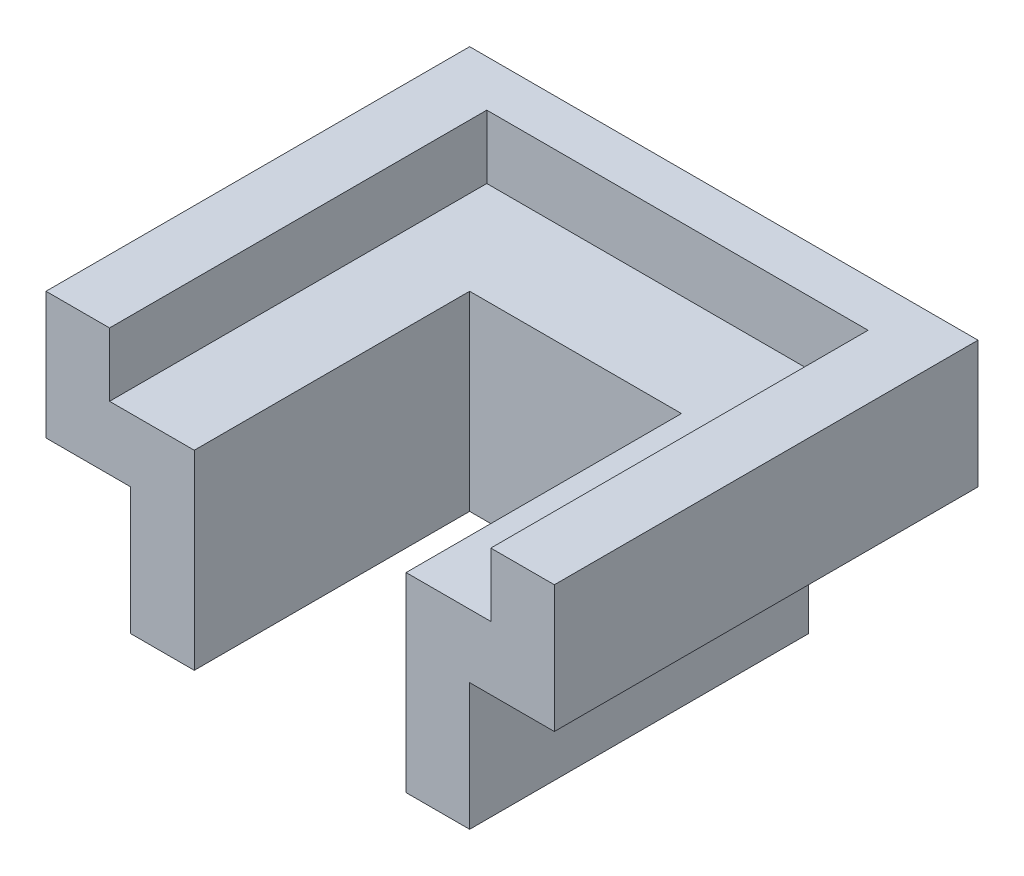
ISO-10303-21;
HEADER;
FILE_DESCRIPTION(('STEP AP214'),'2;1');
FILE_NAME('part.step','',(''),(''),'','','');
FILE_SCHEMA(('AUTOMOTIVE_DESIGN { 1 0 10303 214 1 1 1 1 }'));
ENDSEC;
DATA;
#1=APPLICATION_CONTEXT('core data for automotive mechanical design processes');
#2=APPLICATION_PROTOCOL_DEFINITION('international standard','automotive_design',2000,#1);
#3=PRODUCT_CONTEXT('',#1,'mechanical');
#4=PRODUCT('Part','Part','',(#3));
#5=PRODUCT_RELATED_PRODUCT_CATEGORY('part','',(#4));
#6=PRODUCT_DEFINITION_FORMATION('','',#4);
#7=PRODUCT_DEFINITION_CONTEXT('part definition',#1,'design');
#8=PRODUCT_DEFINITION('design','',#6,#7);
#9=PRODUCT_DEFINITION_SHAPE('','',#8);
#10=(LENGTH_UNIT() NAMED_UNIT(*) SI_UNIT(.MILLI.,.METRE.));
#11=(NAMED_UNIT(*) PLANE_ANGLE_UNIT() SI_UNIT($,.RADIAN.));
#12=(NAMED_UNIT(*) SI_UNIT($,.STERADIAN.) SOLID_ANGLE_UNIT());
#13=UNCERTAINTY_MEASURE_WITH_UNIT(LENGTH_MEASURE(1.E-05),#10,'distance_accuracy_value','');
#14=(GEOMETRIC_REPRESENTATION_CONTEXT(3) GLOBAL_UNCERTAINTY_ASSIGNED_CONTEXT((#13)) GLOBAL_UNIT_ASSIGNED_CONTEXT((#10,
#11,#12)) REPRESENTATION_CONTEXT('',''));
#15=CARTESIAN_POINT('',(0.,0.,0.));
#16=DIRECTION('',(0.,0.,1.));
#17=DIRECTION('',(1.,0.,0.));
#18=AXIS2_PLACEMENT_3D('',#15,#16,#17);
#19=CARTESIAN_POINT('',(38.1,-8.40187074829932,12.2248299319728));
#20=DIRECTION('',(0.,0.,-1.));
#21=DIRECTION('',(-1.,0.,0.));
#22=AXIS2_PLACEMENT_3D('',#19,#20,#21);
#23=PLANE('',#22);
#24=DIRECTION('',(0.,1.,0.));
#25=VECTOR('',#24,1.);
#26=CARTESIAN_POINT('',(-15.875,-27.4518707482993,12.2248299319728));
#27=LINE('',#26,#25);
#28=CARTESIAN_POINT('',(-15.875,-27.4518707482993,12.2248299319728));
#29=VERTEX_POINT('',#28);
#30=CARTESIAN_POINT('',(-15.875,1.12312925170068,12.2248299319728));
#31=VERTEX_POINT('',#30);
#32=EDGE_CURVE('E157',#29,#31,#27,.T.);
#33=ORIENTED_EDGE('',*,*,#32,.T.);
#34=DIRECTION('',(1.,0.,0.));
#35=VECTOR('',#34,1.);
#36=CARTESIAN_POINT('',(-28.575,1.12312925170068,12.2248299319728));
#37=LINE('',#36,#35);
#38=CARTESIAN_POINT('',(-28.575,1.12312925170068,12.2248299319728));
#39=VERTEX_POINT('',#38);
#40=EDGE_CURVE('E170',#39,#31,#37,.T.);
#41=ORIENTED_EDGE('',*,*,#40,.F.);
#42=DIRECTION('',(0.,1.,0.));
#43=VECTOR('',#42,1.);
#44=CARTESIAN_POINT('',(-28.575,1.12312925170068,12.2248299319728));
#45=LINE('',#44,#43);
#46=CARTESIAN_POINT('',(-28.575,10.6481292517007,12.2248299319728));
#47=VERTEX_POINT('',#46);
#48=EDGE_CURVE('E186',#39,#47,#45,.T.);
#49=ORIENTED_EDGE('',*,*,#48,.T.);
#50=DIRECTION('',(-1.,0.,0.));
#51=VECTOR('',#50,1.);
#52=CARTESIAN_POINT('',(38.1,10.6481292517007,12.2248299319728));
#53=LINE('',#52,#51);
#54=CARTESIAN_POINT('',(-38.1,10.6481292517007,12.2248299319728));
#55=VERTEX_POINT('',#54);
#56=EDGE_CURVE('E214',#47,#55,#53,.T.);
#57=ORIENTED_EDGE('',*,*,#56,.T.);
#58=DIRECTION('',(0.,-1.,0.));
#59=VECTOR('',#58,1.);
#60=CARTESIAN_POINT('',(-38.1,-8.40187074829932,12.2248299319728));
#61=LINE('',#60,#59);
#62=CARTESIAN_POINT('',(-38.1,-8.40187074829932,12.2248299319728));
#63=VERTEX_POINT('',#62);
#64=EDGE_CURVE('E198',#55,#63,#61,.T.);
#65=ORIENTED_EDGE('',*,*,#64,.T.);
#66=DIRECTION('',(-1.,0.,0.));
#67=VECTOR('',#66,1.);
#68=CARTESIAN_POINT('',(38.1,-8.40187074829932,12.2248299319728));
#69=LINE('',#68,#67);
#70=CARTESIAN_POINT('',(-25.3999999999999,-8.40187074829932,12.2248299319728));
#71=VERTEX_POINT('',#70);
#72=EDGE_CURVE('E232',#71,#63,#69,.T.);
#73=ORIENTED_EDGE('',*,*,#72,.F.);
#74=DIRECTION('',(0.,1.,0.));
#75=VECTOR('',#74,1.);
#76=CARTESIAN_POINT('',(-25.4,-27.4518707482993,12.2248299319728));
#77=LINE('',#76,#75);
#78=CARTESIAN_POINT('',(-25.4,-27.4518707482993,12.2248299319728));
#79=VERTEX_POINT('',#78);
#80=EDGE_CURVE('E242',#79,#71,#77,.T.);
#81=ORIENTED_EDGE('',*,*,#80,.F.);
#82=DIRECTION('',(-1.,0.,0.));
#83=VECTOR('',#82,1.);
#84=CARTESIAN_POINT('',(-25.4,-27.4518707482993,12.2248299319728));
#85=LINE('',#84,#83);
#86=EDGE_CURVE('E245',#29,#79,#85,.T.);
#87=ORIENTED_EDGE('',*,*,#86,.F.);
#88=EDGE_LOOP('',(#33,#41,#49,#57,#65,#73,#81,#87));
#89=FACE_BOUND('',#88,.T.);
#90=ADVANCED_FACE('F35',(#89),#23,.F.);
#91=CARTESIAN_POINT('',(38.1,-8.40187074829932,12.2248299319728));
#92=DIRECTION('',(0.,1.,0.));
#93=DIRECTION('',(0.,0.,1.));
#94=AXIS2_PLACEMENT_3D('',#91,#92,#93);
#95=PLANE('',#94);
#96=DIRECTION('',(0.,0.,-1.));
#97=VECTOR('',#96,1.);
#98=CARTESIAN_POINT('',(-25.4,-8.40187074829932,12.2248299319728));
#99=LINE('',#98,#97);
#100=CARTESIAN_POINT('',(-25.4,-8.40187074829932,-38.5751700680272));
#101=VERTEX_POINT('',#100);
#102=EDGE_CURVE('E55',#71,#101,#99,.T.);
#103=ORIENTED_EDGE('',*,*,#102,.F.);
#104=ORIENTED_EDGE('',*,*,#72,.T.);
#105=DIRECTION('',(0.,0.,-1.));
#106=VECTOR('',#105,1.);
#107=CARTESIAN_POINT('',(-38.1,-8.40187074829932,12.2248299319728));
#108=LINE('',#107,#106);
#109=CARTESIAN_POINT('',(-38.1,-8.40187074829932,-51.2751700680272));
#110=VERTEX_POINT('',#109);
#111=EDGE_CURVE('E217',#63,#110,#108,.T.);
#112=ORIENTED_EDGE('',*,*,#111,.T.);
#113=DIRECTION('',(-1.,0.,0.));
#114=VECTOR('',#113,1.);
#115=CARTESIAN_POINT('',(38.1,-8.40187074829932,-51.2751700680272));
#116=LINE('',#115,#114);
#117=CARTESIAN_POINT('',(38.1,-8.40187074829932,-51.2751700680272));
#118=VERTEX_POINT('',#117);
#119=EDGE_CURVE('E229',#118,#110,#116,.T.);
#120=ORIENTED_EDGE('',*,*,#119,.F.);
#121=DIRECTION('',(0.,0.,-1.));
#122=VECTOR('',#121,1.);
#123=CARTESIAN_POINT('',(38.1,-8.40187074829932,12.2248299319728));
#124=LINE('',#123,#122);
#125=CARTESIAN_POINT('',(38.1,-8.40187074829932,12.2248299319728));
#126=VERTEX_POINT('',#125);
#127=EDGE_CURVE('E207',#126,#118,#124,.T.);
#128=ORIENTED_EDGE('',*,*,#127,.F.);
#129=CARTESIAN_POINT('',(25.4,-8.40187074829932,12.2248299319728));
#130=VERTEX_POINT('',#129);
#131=EDGE_CURVE('E235',#126,#130,#69,.T.);
#132=ORIENTED_EDGE('',*,*,#131,.T.);
#133=DIRECTION('',(0.,0.,1.));
#134=VECTOR('',#133,1.);
#135=CARTESIAN_POINT('',(25.4,-8.40187074829932,12.2248299319728));
#136=LINE('',#135,#134);
#137=CARTESIAN_POINT('',(25.4,-8.40187074829932,-38.5751700680272));
#138=VERTEX_POINT('',#137);
#139=EDGE_CURVE('E256',#138,#130,#136,.T.);
#140=ORIENTED_EDGE('',*,*,#139,.F.);
#141=DIRECTION('',(1.,0.,0.));
#142=VECTOR('',#141,1.);
#143=CARTESIAN_POINT('',(-25.4,-8.40187074829932,-38.5751700680272));
#144=LINE('',#143,#142);
#145=EDGE_CURVE('E50',#101,#138,#144,.T.);
#146=ORIENTED_EDGE('',*,*,#145,.F.);
#147=EDGE_LOOP('',(#103,#104,#112,#120,#128,#132,#140,#146));
#148=FACE_BOUND('',#147,.T.);
#149=ADVANCED_FACE('F282',(#148),#95,.F.);
#150=CARTESIAN_POINT('',(15.875,1.12312925170068,12.2248299319728));
#151=VERTEX_POINT('',#150);
#152=CARTESIAN_POINT('',(28.575,1.12312925170068,12.2248299319728));
#153=VERTEX_POINT('',#152);
#154=EDGE_CURVE('E177',#151,#153,#37,.T.);
#155=ORIENTED_EDGE('',*,*,#154,.F.);
#156=DIRECTION('',(0.,1.,0.));
#157=VECTOR('',#156,1.);
#158=CARTESIAN_POINT('',(15.875,-27.4518707482993,12.2248299319728));
#159=LINE('',#158,#157);
#160=CARTESIAN_POINT('',(15.875,-27.4518707482993,12.2248299319728));
#161=VERTEX_POINT('',#160);
#162=EDGE_CURVE('E251',#161,#151,#159,.T.);
#163=ORIENTED_EDGE('',*,*,#162,.F.);
#164=DIRECTION('',(-1.,0.,0.));
#165=VECTOR('',#164,1.);
#166=CARTESIAN_POINT('',(15.875,-27.4518707482993,12.2248299319728));
#167=LINE('',#166,#165);
#168=CARTESIAN_POINT('',(25.4,-27.4518707482993,12.2248299319728));
#169=VERTEX_POINT('',#168);
#170=EDGE_CURVE('E311',#169,#161,#167,.T.);
#171=ORIENTED_EDGE('',*,*,#170,.F.);
#172=DIRECTION('',(0.,1.,0.));
#173=VECTOR('',#172,1.);
#174=CARTESIAN_POINT('',(25.4,-27.4518707482993,12.2248299319728));
#175=LINE('',#174,#173);
#176=EDGE_CURVE('E253',#169,#130,#175,.T.);
#177=ORIENTED_EDGE('',*,*,#176,.T.);
#178=ORIENTED_EDGE('',*,*,#131,.F.);
#179=DIRECTION('',(0.,-1.,0.));
#180=VECTOR('',#179,1.);
#181=CARTESIAN_POINT('',(38.1,-8.40187074829932,12.2248299319728));
#182=LINE('',#181,#180);
#183=CARTESIAN_POINT('',(38.1,10.6481292517007,12.2248299319728));
#184=VERTEX_POINT('',#183);
#185=EDGE_CURVE('E204',#184,#126,#182,.T.);
#186=ORIENTED_EDGE('',*,*,#185,.F.);
#187=CARTESIAN_POINT('',(28.575,10.6481292517007,12.2248299319728));
#188=VERTEX_POINT('',#187);
#189=EDGE_CURVE('E223',#184,#188,#53,.T.);
#190=ORIENTED_EDGE('',*,*,#189,.T.);
#191=DIRECTION('',(0.,1.,0.));
#192=VECTOR('',#191,1.);
#193=CARTESIAN_POINT('',(28.575,1.12312925170068,12.2248299319728));
#194=LINE('',#193,#192);
#195=EDGE_CURVE('E201',#153,#188,#194,.T.);
#196=ORIENTED_EDGE('',*,*,#195,.F.);
#197=EDGE_LOOP('',(#155,#163,#171,#177,#178,#186,#190,#196));
#198=FACE_BOUND('',#197,.T.);
#199=ADVANCED_FACE('F37',(#198),#23,.F.);
#200=CARTESIAN_POINT('',(38.1,-8.40187074829932,-51.2751700680272));
#201=DIRECTION('',(0.,0.,1.));
#202=DIRECTION('',(1.,0.,0.));
#203=AXIS2_PLACEMENT_3D('',#200,#201,#202);
#204=PLANE('',#203);
#205=DIRECTION('',(0.,1.,0.));
#206=VECTOR('',#205,1.);
#207=CARTESIAN_POINT('',(-38.1,-8.40187074829932,-51.2751700680272));
#208=LINE('',#207,#206);
#209=CARTESIAN_POINT('',(-38.1,10.6481292517007,-51.2751700680272));
#210=VERTEX_POINT('',#209);
#211=EDGE_CURVE('E219',#110,#210,#208,.T.);
#212=ORIENTED_EDGE('',*,*,#211,.T.);
#213=DIRECTION('',(-1.,0.,0.));
#214=VECTOR('',#213,1.);
#215=CARTESIAN_POINT('',(38.1,10.6481292517007,-51.2751700680272));
#216=LINE('',#215,#214);
#217=CARTESIAN_POINT('',(38.1,10.6481292517007,-51.2751700680272));
#218=VERTEX_POINT('',#217);
#219=EDGE_CURVE('E226',#218,#210,#216,.T.);
#220=ORIENTED_EDGE('',*,*,#219,.F.);
#221=DIRECTION('',(0.,1.,0.));
#222=VECTOR('',#221,1.);
#223=CARTESIAN_POINT('',(38.1,-8.40187074829932,-51.2751700680272));
#224=LINE('',#223,#222);
#225=EDGE_CURVE('E210',#118,#218,#224,.T.);
#226=ORIENTED_EDGE('',*,*,#225,.F.);
#227=ORIENTED_EDGE('',*,*,#119,.T.);
#228=EDGE_LOOP('',(#212,#220,#226,#227));
#229=FACE_BOUND('',#228,.T.);
#230=ADVANCED_FACE('F290',(#229),#204,.F.);
#231=CARTESIAN_POINT('',(38.1,10.6481292517007,12.2248299319728));
#232=DIRECTION('',(0.,-1.,0.));
#233=DIRECTION('',(0.,0.,-1.));
#234=AXIS2_PLACEMENT_3D('',#231,#232,#233);
#235=PLANE('',#234);
#236=ORIENTED_EDGE('',*,*,#56,.F.);
#237=DIRECTION('',(0.,0.,1.));
#238=VECTOR('',#237,1.);
#239=CARTESIAN_POINT('',(-28.575,10.6481292517007,12.2248299319728));
#240=LINE('',#239,#238);
#241=CARTESIAN_POINT('',(-28.575,10.6481292517007,-44.3216796088564));
#242=VERTEX_POINT('',#241);
#243=EDGE_CURVE('E187',#242,#47,#240,.T.);
#244=ORIENTED_EDGE('',*,*,#243,.F.);
#245=DIRECTION('',(-1.,0.,0.));
#246=VECTOR('',#245,1.);
#247=CARTESIAN_POINT('',(-28.575,10.6481292517007,-44.3216796088564));
#248=LINE('',#247,#246);
#249=CARTESIAN_POINT('',(28.575,10.6481292517007,-44.3216796088564));
#250=VERTEX_POINT('',#249);
#251=EDGE_CURVE('E193',#250,#242,#248,.T.);
#252=ORIENTED_EDGE('',*,*,#251,.F.);
#253=DIRECTION('',(0.,0.,-1.));
#254=VECTOR('',#253,1.);
#255=CARTESIAN_POINT('',(28.575,10.6481292517007,12.2248299319728));
#256=LINE('',#255,#254);
#257=EDGE_CURVE('E189',#188,#250,#256,.T.);
#258=ORIENTED_EDGE('',*,*,#257,.F.);
#259=ORIENTED_EDGE('',*,*,#189,.F.);
#260=DIRECTION('',(0.,0.,1.));
#261=VECTOR('',#260,1.);
#262=CARTESIAN_POINT('',(38.1,10.6481292517007,12.2248299319728));
#263=LINE('',#262,#261);
#264=EDGE_CURVE('E212',#218,#184,#263,.T.);
#265=ORIENTED_EDGE('',*,*,#264,.F.);
#266=ORIENTED_EDGE('',*,*,#219,.T.);
#267=DIRECTION('',(0.,0.,1.));
#268=VECTOR('',#267,1.);
#269=CARTESIAN_POINT('',(-38.1,10.6481292517007,12.2248299319728));
#270=LINE('',#269,#268);
#271=EDGE_CURVE('E208',#210,#55,#270,.T.);
#272=ORIENTED_EDGE('',*,*,#271,.T.);
#273=EDGE_LOOP('',(#236,#244,#252,#258,#259,#265,#266,#272));
#274=FACE_BOUND('',#273,.T.);
#275=ADVANCED_FACE('F295',(#274),#235,.F.);
#276=CARTESIAN_POINT('',(38.1,0.,0.));
#277=DIRECTION('',(-1.,0.,0.));
#278=DIRECTION('',(0.,0.,1.));
#279=AXIS2_PLACEMENT_3D('',#276,#277,#278);
#280=PLANE('',#279);
#281=ORIENTED_EDGE('',*,*,#185,.T.);
#282=ORIENTED_EDGE('',*,*,#127,.T.);
#283=ORIENTED_EDGE('',*,*,#225,.T.);
#284=ORIENTED_EDGE('',*,*,#264,.T.);
#285=EDGE_LOOP('',(#281,#282,#283,#284));
#286=FACE_BOUND('',#285,.T.);
#287=ADVANCED_FACE('F300',(#286),#280,.F.);
#288=CARTESIAN_POINT('',(-38.1,0.,0.));
#289=DIRECTION('',(-1.,0.,0.));
#290=DIRECTION('',(0.,0.,1.));
#291=AXIS2_PLACEMENT_3D('',#288,#289,#290);
#292=PLANE('',#291);
#293=ORIENTED_EDGE('',*,*,#64,.F.);
#294=ORIENTED_EDGE('',*,*,#271,.F.);
#295=ORIENTED_EDGE('',*,*,#211,.F.);
#296=ORIENTED_EDGE('',*,*,#111,.F.);
#297=EDGE_LOOP('',(#293,#294,#295,#296));
#298=FACE_BOUND('',#297,.T.);
#299=ADVANCED_FACE('F286',(#298),#292,.T.);
#300=CARTESIAN_POINT('',(-28.575,1.12312925170068,12.2248299319728));
#301=DIRECTION('',(-1.,0.,0.));
#302=DIRECTION('',(0.,0.,1.));
#303=AXIS2_PLACEMENT_3D('',#300,#301,#302);
#304=PLANE('',#303);
#305=ORIENTED_EDGE('',*,*,#243,.T.);
#306=ORIENTED_EDGE('',*,*,#48,.F.);
#307=DIRECTION('',(0.,0.,1.));
#308=VECTOR('',#307,1.);
#309=CARTESIAN_POINT('',(-28.575,1.12312925170068,12.2248299319728));
#310=LINE('',#309,#308);
#311=CARTESIAN_POINT('',(-28.575,1.12312925170068,-44.3216796088564));
#312=VERTEX_POINT('',#311);
#313=EDGE_CURVE('E173',#312,#39,#310,.T.);
#314=ORIENTED_EDGE('',*,*,#313,.F.);
#315=DIRECTION('',(0.,1.,0.));
#316=VECTOR('',#315,1.);
#317=CARTESIAN_POINT('',(-28.575,1.12312925170068,-44.3216796088564));
#318=LINE('',#317,#316);
#319=EDGE_CURVE('E196',#312,#242,#318,.T.);
#320=ORIENTED_EDGE('',*,*,#319,.T.);
#321=EDGE_LOOP('',(#305,#306,#314,#320));
#322=FACE_BOUND('',#321,.T.);
#323=ADVANCED_FACE('F337',(#322),#304,.F.);
#324=CARTESIAN_POINT('',(-28.575,1.12312925170068,-44.3216796088564));
#325=DIRECTION('',(0.,0.,-1.));
#326=DIRECTION('',(-1.,0.,0.));
#327=AXIS2_PLACEMENT_3D('',#324,#325,#326);
#328=PLANE('',#327);
#329=ORIENTED_EDGE('',*,*,#251,.T.);
#330=ORIENTED_EDGE('',*,*,#319,.F.);
#331=DIRECTION('',(-1.,0.,0.));
#332=VECTOR('',#331,1.);
#333=CARTESIAN_POINT('',(-28.575,1.12312925170068,-44.3216796088564));
#334=LINE('',#333,#332);
#335=CARTESIAN_POINT('',(28.575,1.12312925170068,-44.3216796088564));
#336=VERTEX_POINT('',#335);
#337=EDGE_CURVE('E180',#336,#312,#334,.T.);
#338=ORIENTED_EDGE('',*,*,#337,.F.);
#339=DIRECTION('',(0.,1.,0.));
#340=VECTOR('',#339,1.);
#341=CARTESIAN_POINT('',(28.575,1.12312925170068,-44.3216796088564));
#342=LINE('',#341,#340);
#343=EDGE_CURVE('E199',#336,#250,#342,.T.);
#344=ORIENTED_EDGE('',*,*,#343,.T.);
#345=EDGE_LOOP('',(#329,#330,#338,#344));
#346=FACE_BOUND('',#345,.T.);
#347=ADVANCED_FACE('F334',(#346),#328,.F.);
#348=CARTESIAN_POINT('',(28.575,1.12312925170068,12.2248299319728));
#349=DIRECTION('',(1.,0.,0.));
#350=DIRECTION('',(0.,0.,-1.));
#351=AXIS2_PLACEMENT_3D('',#348,#349,#350);
#352=PLANE('',#351);
#353=ORIENTED_EDGE('',*,*,#257,.T.);
#354=ORIENTED_EDGE('',*,*,#343,.F.);
#355=DIRECTION('',(0.,0.,-1.));
#356=VECTOR('',#355,1.);
#357=CARTESIAN_POINT('',(28.575,1.12312925170068,12.2248299319728));
#358=LINE('',#357,#356);
#359=EDGE_CURVE('E176',#153,#336,#358,.T.);
#360=ORIENTED_EDGE('',*,*,#359,.F.);
#361=ORIENTED_EDGE('',*,*,#195,.T.);
#362=EDGE_LOOP('',(#353,#354,#360,#361));
#363=FACE_BOUND('',#362,.T.);
#364=ADVANCED_FACE('F330',(#363),#352,.F.);
#365=CARTESIAN_POINT('',(0.,1.12312925170068,0.));
#366=DIRECTION('',(0.,-1.,0.));
#367=DIRECTION('',(0.,0.,-1.));
#368=AXIS2_PLACEMENT_3D('',#365,#366,#367);
#369=PLANE('',#368);
#370=ORIENTED_EDGE('',*,*,#40,.T.);
#371=DIRECTION('',(0.,0.,-1.));
#372=VECTOR('',#371,1.);
#373=CARTESIAN_POINT('',(-15.875,1.12312925170068,0.));
#374=LINE('',#373,#372);
#375=CARTESIAN_POINT('',(-15.875,1.12312925170068,-29.0501700680272));
#376=VERTEX_POINT('',#375);
#377=EDGE_CURVE('E11',#31,#376,#374,.T.);
#378=ORIENTED_EDGE('',*,*,#377,.T.);
#379=DIRECTION('',(1.,0.,0.));
#380=VECTOR('',#379,1.);
#381=CARTESIAN_POINT('',(0.,1.12312925170068,-29.0501700680272));
#382=LINE('',#381,#380);
#383=CARTESIAN_POINT('',(15.875,1.12312925170068,-29.0501700680272));
#384=VERTEX_POINT('',#383);
#385=EDGE_CURVE('E160',#376,#384,#382,.T.);
#386=ORIENTED_EDGE('',*,*,#385,.T.);
#387=DIRECTION('',(0.,0.,1.));
#388=VECTOR('',#387,1.);
#389=CARTESIAN_POINT('',(15.875,1.12312925170068,0.));
#390=LINE('',#389,#388);
#391=EDGE_CURVE('E43',#384,#151,#390,.T.);
#392=ORIENTED_EDGE('',*,*,#391,.T.);
#393=ORIENTED_EDGE('',*,*,#154,.T.);
#394=ORIENTED_EDGE('',*,*,#359,.T.);
#395=ORIENTED_EDGE('',*,*,#337,.T.);
#396=ORIENTED_EDGE('',*,*,#313,.T.);
#397=EDGE_LOOP('',(#370,#378,#386,#392,#393,#394,#395,#396));
#398=FACE_BOUND('',#397,.T.);
#399=ADVANCED_FACE('F167',(#398),#369,.F.);
#400=CARTESIAN_POINT('',(-25.4,-27.4518707482993,12.2248299319728));
#401=DIRECTION('',(1.,0.,0.));
#402=DIRECTION('',(0.,0.,-1.));
#403=AXIS2_PLACEMENT_3D('',#400,#401,#402);
#404=PLANE('',#403);
#405=ORIENTED_EDGE('',*,*,#102,.T.);
#406=DIRECTION('',(0.,1.,0.));
#407=VECTOR('',#406,1.);
#408=CARTESIAN_POINT('',(-25.4,-27.4518707482993,-38.5751700680272));
#409=LINE('',#408,#407);
#410=CARTESIAN_POINT('',(-25.4,-27.4518707482993,-38.5751700680272));
#411=VERTEX_POINT('',#410);
#412=EDGE_CURVE('E190',#411,#101,#409,.T.);
#413=ORIENTED_EDGE('',*,*,#412,.F.);
#414=DIRECTION('',(0.,0.,-1.));
#415=VECTOR('',#414,1.);
#416=CARTESIAN_POINT('',(-25.4,-27.4518707482993,12.2248299319728));
#417=LINE('',#416,#415);
#418=EDGE_CURVE('E260',#79,#411,#417,.T.);
#419=ORIENTED_EDGE('',*,*,#418,.F.);
#420=ORIENTED_EDGE('',*,*,#80,.T.);
#421=EDGE_LOOP('',(#405,#413,#419,#420));
#422=FACE_BOUND('',#421,.T.);
#423=ADVANCED_FACE('F277',(#422),#404,.F.);
#424=CARTESIAN_POINT('',(-25.4,-27.4518707482993,-38.5751700680272));
#425=DIRECTION('',(0.,0.,1.));
#426=DIRECTION('',(1.,0.,0.));
#427=AXIS2_PLACEMENT_3D('',#424,#425,#426);
#428=PLANE('',#427);
#429=ORIENTED_EDGE('',*,*,#145,.T.);
#430=DIRECTION('',(0.,1.,0.));
#431=VECTOR('',#430,1.);
#432=CARTESIAN_POINT('',(25.4,-27.4518707482993,-38.5751700680272));
#433=LINE('',#432,#431);
#434=CARTESIAN_POINT('',(25.4,-27.4518707482993,-38.5751700680272));
#435=VERTEX_POINT('',#434);
#436=EDGE_CURVE('E267',#435,#138,#433,.T.);
#437=ORIENTED_EDGE('',*,*,#436,.F.);
#438=DIRECTION('',(1.,0.,0.));
#439=VECTOR('',#438,1.);
#440=CARTESIAN_POINT('',(-25.4,-27.4518707482993,-38.5751700680272));
#441=LINE('',#440,#439);
#442=EDGE_CURVE('E273',#411,#435,#441,.T.);
#443=ORIENTED_EDGE('',*,*,#442,.F.);
#444=ORIENTED_EDGE('',*,*,#412,.T.);
#445=EDGE_LOOP('',(#429,#437,#443,#444));
#446=FACE_BOUND('',#445,.T.);
#447=ADVANCED_FACE('F271',(#446),#428,.F.);
#448=CARTESIAN_POINT('',(25.4,-27.4518707482993,12.2248299319728));
#449=DIRECTION('',(-1.,0.,0.));
#450=DIRECTION('',(0.,0.,1.));
#451=AXIS2_PLACEMENT_3D('',#448,#449,#450);
#452=PLANE('',#451);
#453=ORIENTED_EDGE('',*,*,#139,.T.);
#454=ORIENTED_EDGE('',*,*,#176,.F.);
#455=DIRECTION('',(0.,0.,1.));
#456=VECTOR('',#455,1.);
#457=CARTESIAN_POINT('',(25.4,-27.4518707482993,12.2248299319728));
#458=LINE('',#457,#456);
#459=EDGE_CURVE('E315',#435,#169,#458,.T.);
#460=ORIENTED_EDGE('',*,*,#459,.F.);
#461=ORIENTED_EDGE('',*,*,#436,.T.);
#462=EDGE_LOOP('',(#453,#454,#460,#461));
#463=FACE_BOUND('',#462,.T.);
#464=ADVANCED_FACE('F306',(#463),#452,.F.);
#465=CARTESIAN_POINT('',(15.875,-27.4518707482993,-29.0501700680272));
#466=DIRECTION('',(1.,0.,0.));
#467=DIRECTION('',(0.,0.,-1.));
#468=AXIS2_PLACEMENT_3D('',#465,#466,#467);
#469=PLANE('',#468);
#470=ORIENTED_EDGE('',*,*,#162,.T.);
#471=ORIENTED_EDGE('',*,*,#391,.F.);
#472=DIRECTION('',(0.,1.,0.));
#473=VECTOR('',#472,1.);
#474=CARTESIAN_POINT('',(15.875,-27.4518707482993,-29.0501700680272));
#475=LINE('',#474,#473);
#476=CARTESIAN_POINT('',(15.875,-27.4518707482993,-29.0501700680272));
#477=VERTEX_POINT('',#476);
#478=EDGE_CURVE('E156',#477,#384,#475,.T.);
#479=ORIENTED_EDGE('',*,*,#478,.F.);
#480=DIRECTION('',(0.,0.,-1.));
#481=VECTOR('',#480,1.);
#482=CARTESIAN_POINT('',(15.875,-27.4518707482993,-29.0501700680272));
#483=LINE('',#482,#481);
#484=EDGE_CURVE('E314',#161,#477,#483,.T.);
#485=ORIENTED_EDGE('',*,*,#484,.F.);
#486=EDGE_LOOP('',(#470,#471,#479,#485));
#487=FACE_BOUND('',#486,.T.);
#488=ADVANCED_FACE('F325',(#487),#469,.F.);
#489=CARTESIAN_POINT('',(-15.875,-27.4518707482993,-29.0501700680272));
#490=DIRECTION('',(0.,0.,-1.));
#491=DIRECTION('',(-1.,0.,0.));
#492=AXIS2_PLACEMENT_3D('',#489,#490,#491);
#493=PLANE('',#492);
#494=ORIENTED_EDGE('',*,*,#478,.T.);
#495=ORIENTED_EDGE('',*,*,#385,.F.);
#496=DIRECTION('',(0.,1.,0.));
#497=VECTOR('',#496,1.);
#498=CARTESIAN_POINT('',(-15.875,-27.4518707482993,-29.0501700680272));
#499=LINE('',#498,#497);
#500=CARTESIAN_POINT('',(-15.875,-27.4518707482993,-29.0501700680272));
#501=VERTEX_POINT('',#500);
#502=EDGE_CURVE('E148',#501,#376,#499,.T.);
#503=ORIENTED_EDGE('',*,*,#502,.F.);
#504=DIRECTION('',(-1.,0.,0.));
#505=VECTOR('',#504,1.);
#506=CARTESIAN_POINT('',(-15.875,-27.4518707482993,-29.0501700680272));
#507=LINE('',#506,#505);
#508=EDGE_CURVE('E317',#477,#501,#507,.T.);
#509=ORIENTED_EDGE('',*,*,#508,.F.);
#510=EDGE_LOOP('',(#494,#495,#503,#509));
#511=FACE_BOUND('',#510,.T.);
#512=ADVANCED_FACE('F161',(#511),#493,.F.);
#513=CARTESIAN_POINT('',(-15.875,-27.4518707482993,12.2248299319728));
#514=DIRECTION('',(-1.,0.,0.));
#515=DIRECTION('',(0.,0.,1.));
#516=AXIS2_PLACEMENT_3D('',#513,#514,#515);
#517=PLANE('',#516);
#518=ORIENTED_EDGE('',*,*,#502,.T.);
#519=ORIENTED_EDGE('',*,*,#377,.F.);
#520=ORIENTED_EDGE('',*,*,#32,.F.);
#521=DIRECTION('',(0.,0.,1.));
#522=VECTOR('',#521,1.);
#523=CARTESIAN_POINT('',(-15.875,-27.4518707482993,12.2248299319728));
#524=LINE('',#523,#522);
#525=EDGE_CURVE('E153',#501,#29,#524,.T.);
#526=ORIENTED_EDGE('',*,*,#525,.F.);
#527=EDGE_LOOP('',(#518,#519,#520,#526));
#528=FACE_BOUND('',#527,.T.);
#529=ADVANCED_FACE('F150',(#528),#517,.F.);
#530=CARTESIAN_POINT('',(0.,-27.4518707482993,0.));
#531=DIRECTION('',(0.,-1.,0.));
#532=DIRECTION('',(0.,0.,-1.));
#533=AXIS2_PLACEMENT_3D('',#530,#531,#532);
#534=PLANE('',#533);
#535=ORIENTED_EDGE('',*,*,#418,.T.);
#536=ORIENTED_EDGE('',*,*,#442,.T.);
#537=ORIENTED_EDGE('',*,*,#459,.T.);
#538=ORIENTED_EDGE('',*,*,#170,.T.);
#539=ORIENTED_EDGE('',*,*,#484,.T.);
#540=ORIENTED_EDGE('',*,*,#508,.T.);
#541=ORIENTED_EDGE('',*,*,#525,.T.);
#542=ORIENTED_EDGE('',*,*,#86,.T.);
#543=EDGE_LOOP('',(#535,#536,#537,#538,#539,#540,#541,#542));
#544=FACE_BOUND('',#543,.T.);
#545=ADVANCED_FACE('F323',(#544),#534,.T.);
#546=CLOSED_SHELL('',(#90,#149,#199,#230,#275,#287,#299,#323,#347,#364,#399,#423,#447,#464,#488,
#512,#529,#545));
#547=MANIFOLD_SOLID_BREP('B2',#546);
#548=ADVANCED_BREP_SHAPE_REPRESENTATION('',(#18,#547),#14);
#549=SHAPE_DEFINITION_REPRESENTATION(#9,#548);
ENDSEC;
END-ISO-10303-21;
